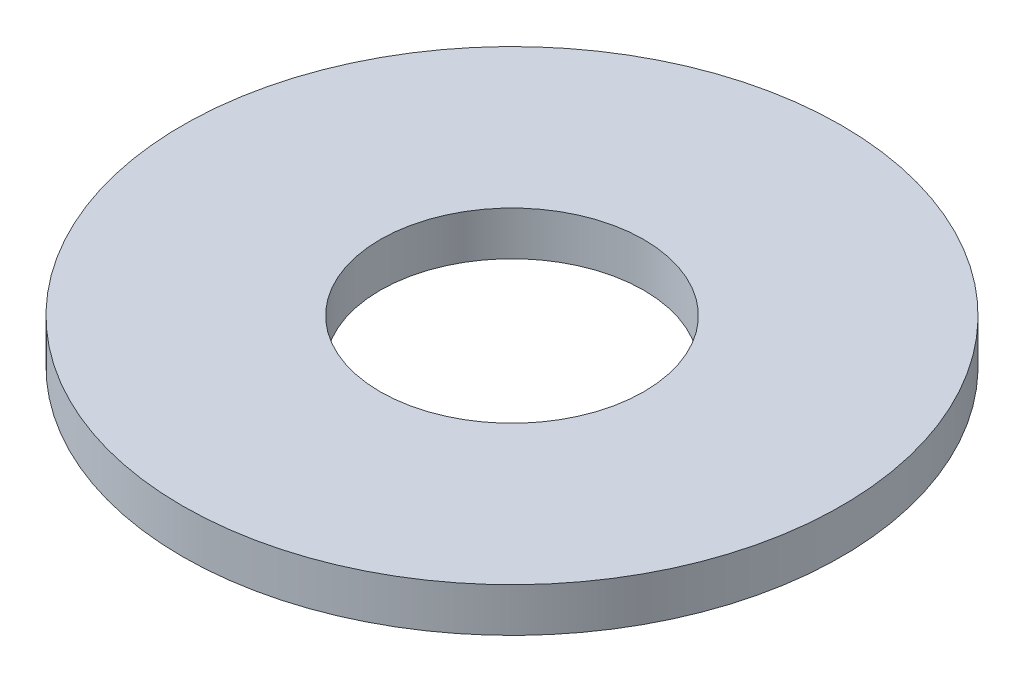
ISO-10303-21;
HEADER;
FILE_DESCRIPTION(('STEP AP214'),'2;1');
FILE_NAME('part.step','',(''),(''),'','','');
FILE_SCHEMA(('AUTOMOTIVE_DESIGN { 1 0 10303 214 1 1 1 1 }'));
ENDSEC;
DATA;
#1=APPLICATION_CONTEXT('core data for automotive mechanical design processes');
#2=APPLICATION_PROTOCOL_DEFINITION('international standard','automotive_design',2000,#1);
#3=PRODUCT_CONTEXT('',#1,'mechanical');
#4=PRODUCT('Part','Part','',(#3));
#5=PRODUCT_RELATED_PRODUCT_CATEGORY('part','',(#4));
#6=PRODUCT_DEFINITION_FORMATION('','',#4);
#7=PRODUCT_DEFINITION_CONTEXT('part definition',#1,'design');
#8=PRODUCT_DEFINITION('design','',#6,#7);
#9=PRODUCT_DEFINITION_SHAPE('','',#8);
#10=(LENGTH_UNIT() NAMED_UNIT(*) SI_UNIT(.MILLI.,.METRE.));
#11=(NAMED_UNIT(*) PLANE_ANGLE_UNIT() SI_UNIT($,.RADIAN.));
#12=(NAMED_UNIT(*) SI_UNIT($,.STERADIAN.) SOLID_ANGLE_UNIT());
#13=UNCERTAINTY_MEASURE_WITH_UNIT(LENGTH_MEASURE(1.E-05),#10,'distance_accuracy_value','');
#14=(GEOMETRIC_REPRESENTATION_CONTEXT(3) GLOBAL_UNCERTAINTY_ASSIGNED_CONTEXT((#13)) GLOBAL_UNIT_ASSIGNED_CONTEXT((#10,
#11,#12)) REPRESENTATION_CONTEXT('',''));
#15=CARTESIAN_POINT('',(0.,0.,0.));
#16=DIRECTION('',(0.,0.,1.));
#17=DIRECTION('',(1.,0.,0.));
#18=AXIS2_PLACEMENT_3D('',#15,#16,#17);
#19=CARTESIAN_POINT('',(0.,10.,0.));
#20=DIRECTION('',(0.,-1.,0.));
#21=DIRECTION('',(0.,0.,-1.));
#22=AXIS2_PLACEMENT_3D('',#19,#20,#21);
#23=CYLINDRICAL_SURFACE('',#22,75.);
#24=CARTESIAN_POINT('',(0.,10.,0.));
#25=DIRECTION('',(0.,1.,0.));
#26=DIRECTION('',(0.,0.,1.));
#27=AXIS2_PLACEMENT_3D('',#24,#25,#26);
#28=CIRCLE('',#27,75.);
#29=CARTESIAN_POINT('',(0.,10.,75.));
#30=VERTEX_POINT('',#29);
#31=EDGE_CURVE('E10',#30,#30,#28,.T.);
#32=ORIENTED_EDGE('',*,*,#31,.F.);
#33=EDGE_LOOP('',(#32));
#34=FACE_BOUND('',#33,.T.);
#35=CARTESIAN_POINT('',(0.,0.,0.));
#36=DIRECTION('',(0.,1.,0.));
#37=DIRECTION('',(0.,0.,1.));
#38=AXIS2_PLACEMENT_3D('',#35,#36,#37);
#39=CIRCLE('',#38,75.);
#40=CARTESIAN_POINT('',(0.,0.,75.));
#41=VERTEX_POINT('',#40);
#42=EDGE_CURVE('E37',#41,#41,#39,.T.);
#43=ORIENTED_EDGE('',*,*,#42,.T.);
#44=EDGE_LOOP('',(#43));
#45=FACE_BOUND('',#44,.T.);
#46=ADVANCED_FACE('F40',(#34,#45),#23,.T.);
#47=CARTESIAN_POINT('',(0.,10.,0.));
#48=DIRECTION('',(0.,1.,0.));
#49=DIRECTION('',(0.,0.,1.));
#50=AXIS2_PLACEMENT_3D('',#47,#48,#49);
#51=PLANE('',#50);
#52=CARTESIAN_POINT('',(0.,10.,0.));
#53=DIRECTION('',(0.,1.,0.));
#54=DIRECTION('',(0.,0.,1.));
#55=AXIS2_PLACEMENT_3D('',#52,#53,#54);
#56=CIRCLE('',#55,30.);
#57=CARTESIAN_POINT('',(0.,10.,30.));
#58=VERTEX_POINT('',#57);
#59=EDGE_CURVE('E50',#58,#58,#56,.T.);
#60=ORIENTED_EDGE('',*,*,#59,.F.);
#61=EDGE_LOOP('',(#60));
#62=FACE_BOUND('',#61,.T.);
#63=ORIENTED_EDGE('',*,*,#31,.T.);
#64=EDGE_LOOP('',(#63));
#65=FACE_BOUND('',#64,.T.);
#66=ADVANCED_FACE('F59',(#62,#65),#51,.T.);
#67=CARTESIAN_POINT('',(0.,0.,0.));
#68=DIRECTION('',(0.,1.,0.));
#69=DIRECTION('',(0.,0.,1.));
#70=AXIS2_PLACEMENT_3D('',#67,#68,#69);
#71=PLANE('',#70);
#72=CARTESIAN_POINT('',(0.,0.,0.));
#73=DIRECTION('',(0.,1.,0.));
#74=DIRECTION('',(0.,0.,1.));
#75=AXIS2_PLACEMENT_3D('',#72,#73,#74);
#76=CIRCLE('',#75,30.);
#77=CARTESIAN_POINT('',(0.,0.,30.));
#78=VERTEX_POINT('',#77);
#79=EDGE_CURVE('E47',#78,#78,#76,.T.);
#80=ORIENTED_EDGE('',*,*,#79,.T.);
#81=EDGE_LOOP('',(#80));
#82=FACE_BOUND('',#81,.T.);
#83=ORIENTED_EDGE('',*,*,#42,.F.);
#84=EDGE_LOOP('',(#83));
#85=FACE_BOUND('',#84,.T.);
#86=ADVANCED_FACE('F58',(#82,#85),#71,.F.);
#87=CARTESIAN_POINT('',(0.,10.,0.));
#88=DIRECTION('',(0.,-1.,0.));
#89=DIRECTION('',(0.,0.,-1.));
#90=AXIS2_PLACEMENT_3D('',#87,#88,#89);
#91=CYLINDRICAL_SURFACE('',#90,30.);
#92=ORIENTED_EDGE('',*,*,#59,.T.);
#93=EDGE_LOOP('',(#92));
#94=FACE_BOUND('',#93,.T.);
#95=ORIENTED_EDGE('',*,*,#79,.F.);
#96=EDGE_LOOP('',(#95));
#97=FACE_BOUND('',#96,.T.);
#98=ADVANCED_FACE('F54',(#94,#97),#91,.F.);
#99=CLOSED_SHELL('',(#46,#66,#86,#98));
#100=MANIFOLD_SOLID_BREP('B2',#99);
#101=ADVANCED_BREP_SHAPE_REPRESENTATION('',(#18,#100),#14);
#102=SHAPE_DEFINITION_REPRESENTATION(#9,#101);
ENDSEC;
END-ISO-10303-21;
